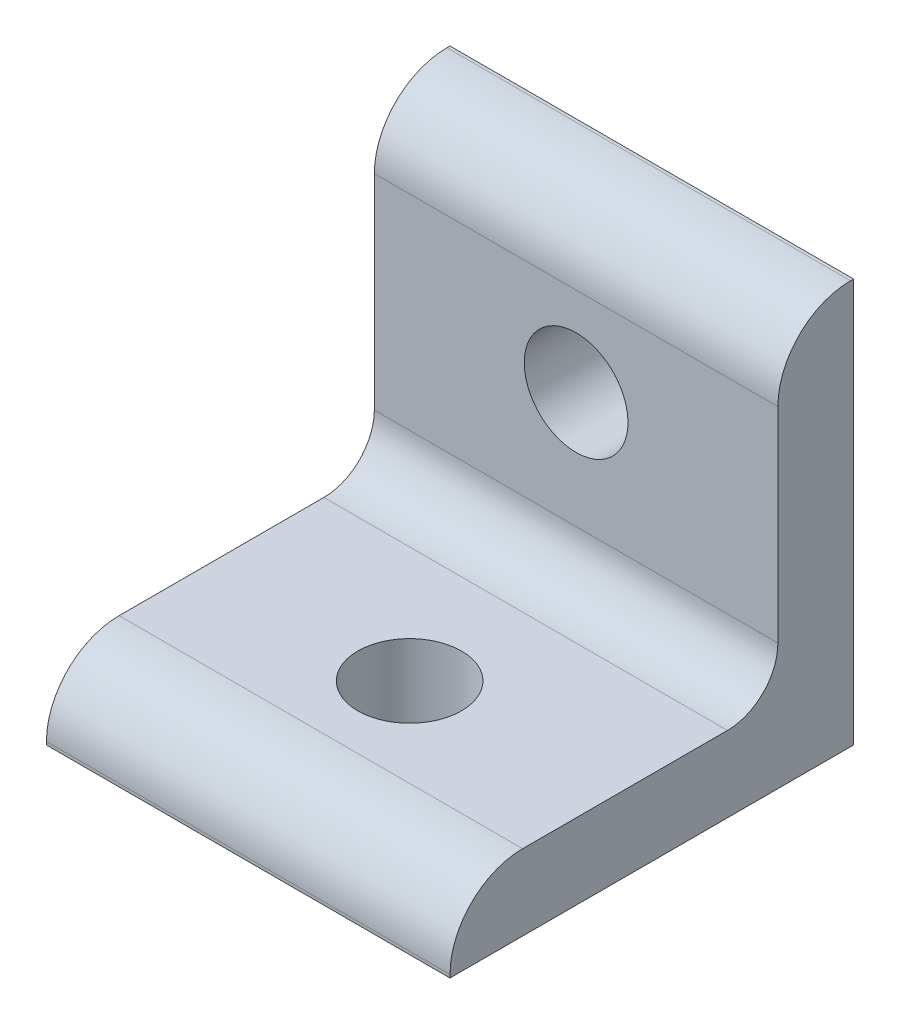
ISO-10303-21;
HEADER;
FILE_DESCRIPTION(('STEP AP214'),'2;1');
FILE_NAME('part.step','',(''),(''),'','','');
FILE_SCHEMA(('AUTOMOTIVE_DESIGN { 1 0 10303 214 1 1 1 1 }'));
ENDSEC;
DATA;
#1=APPLICATION_CONTEXT('core data for automotive mechanical design processes');
#2=APPLICATION_PROTOCOL_DEFINITION('international standard','automotive_design',2000,#1);
#3=PRODUCT_CONTEXT('',#1,'mechanical');
#4=PRODUCT('Part','Part','',(#3));
#5=PRODUCT_RELATED_PRODUCT_CATEGORY('part','',(#4));
#6=PRODUCT_DEFINITION_FORMATION('','',#4);
#7=PRODUCT_DEFINITION_CONTEXT('part definition',#1,'design');
#8=PRODUCT_DEFINITION('design','',#6,#7);
#9=PRODUCT_DEFINITION_SHAPE('','',#8);
#10=(LENGTH_UNIT() NAMED_UNIT(*) SI_UNIT(.MILLI.,.METRE.));
#11=(NAMED_UNIT(*) PLANE_ANGLE_UNIT() SI_UNIT($,.RADIAN.));
#12=(NAMED_UNIT(*) SI_UNIT($,.STERADIAN.) SOLID_ANGLE_UNIT());
#13=UNCERTAINTY_MEASURE_WITH_UNIT(LENGTH_MEASURE(1.E-05),#10,'distance_accuracy_value','');
#14=(GEOMETRIC_REPRESENTATION_CONTEXT(3) GLOBAL_UNCERTAINTY_ASSIGNED_CONTEXT((#13)) GLOBAL_UNIT_ASSIGNED_CONTEXT((#10,
#11,#12)) REPRESENTATION_CONTEXT('',''));
#15=CARTESIAN_POINT('',(0.,0.,0.));
#16=DIRECTION('',(0.,0.,1.));
#17=DIRECTION('',(1.,0.,0.));
#18=AXIS2_PLACEMENT_3D('',#15,#16,#17);
#19=CARTESIAN_POINT('',(25.4,25.4,0.));
#20=DIRECTION('',(0.,0.,-1.));
#21=DIRECTION('',(-1.,0.,0.));
#22=AXIS2_PLACEMENT_3D('',#19,#20,#21);
#23=PLANE('',#22);
#24=CARTESIAN_POINT('',(12.7,15.24,0.));
#25=DIRECTION('',(0.,0.,-1.));
#26=DIRECTION('',(-1.,0.,0.));
#27=AXIS2_PLACEMENT_3D('',#24,#25,#26);
#28=CIRCLE('',#27,3.2639);
#29=CARTESIAN_POINT('',(9.4361,15.24,0.));
#30=VERTEX_POINT('',#29);
#31=EDGE_CURVE('E224',#30,#30,#28,.T.);
#32=ORIENTED_EDGE('',*,*,#31,.F.);
#33=EDGE_LOOP('',(#32));
#34=FACE_BOUND('',#33,.T.);
#35=DIRECTION('',(0.,-1.,0.));
#36=VECTOR('',#35,1.);
#37=CARTESIAN_POINT('',(0.,25.4,0.));
#38=LINE('',#37,#36);
#39=CARTESIAN_POINT('',(0.,25.4,0.));
#40=VERTEX_POINT('',#39);
#41=CARTESIAN_POINT('',(0.,0.,0.));
#42=VERTEX_POINT('',#41);
#43=EDGE_CURVE('E144',#40,#42,#38,.T.);
#44=ORIENTED_EDGE('',*,*,#43,.F.);
#45=DIRECTION('',(-1.,0.,0.));
#46=VECTOR('',#45,1.);
#47=CARTESIAN_POINT('',(25.4,25.4,0.));
#48=LINE('',#47,#46);
#49=CARTESIAN_POINT('',(25.4,25.4,0.));
#50=VERTEX_POINT('',#49);
#51=EDGE_CURVE('E11',#50,#40,#48,.T.);
#52=ORIENTED_EDGE('',*,*,#51,.F.);
#53=DIRECTION('',(0.,-1.,0.));
#54=VECTOR('',#53,1.);
#55=CARTESIAN_POINT('',(25.4,25.4,0.));
#56=LINE('',#55,#54);
#57=CARTESIAN_POINT('',(25.4,0.,0.));
#58=VERTEX_POINT('',#57);
#59=EDGE_CURVE('E168',#50,#58,#56,.T.);
#60=ORIENTED_EDGE('',*,*,#59,.T.);
#61=DIRECTION('',(-1.,0.,0.));
#62=VECTOR('',#61,1.);
#63=CARTESIAN_POINT('',(25.4,0.,0.));
#64=LINE('',#63,#62);
#65=EDGE_CURVE('E44',#58,#42,#64,.T.);
#66=ORIENTED_EDGE('',*,*,#65,.T.);
#67=EDGE_LOOP('',(#44,#52,#60,#66));
#68=FACE_BOUND('',#67,.T.);
#69=ADVANCED_FACE('F41',(#34,#68),#23,.T.);
#70=CARTESIAN_POINT('',(25.4,25.4,0.));
#71=DIRECTION('',(0.,1.,0.));
#72=DIRECTION('',(0.,0.,1.));
#73=AXIS2_PLACEMENT_3D('',#70,#71,#72);
#74=PLANE('',#73);
#75=DIRECTION('',(0.,0.,-1.));
#76=VECTOR('',#75,1.);
#77=CARTESIAN_POINT('',(0.,25.4,0.));
#78=LINE('',#77,#76);
#79=CARTESIAN_POINT('',(0.,25.4,0.190499999999996));
#80=VERTEX_POINT('',#79);
#81=EDGE_CURVE('E166',#80,#40,#78,.T.);
#82=ORIENTED_EDGE('',*,*,#81,.F.);
#83=DIRECTION('',(-1.,0.,0.));
#84=VECTOR('',#83,1.);
#85=CARTESIAN_POINT('',(25.4,25.4,0.190499999999996));
#86=LINE('',#85,#84);
#87=CARTESIAN_POINT('',(25.4,25.4,0.190499999999996));
#88=VERTEX_POINT('',#87);
#89=EDGE_CURVE('E50',#88,#80,#86,.T.);
#90=ORIENTED_EDGE('',*,*,#89,.F.);
#91=DIRECTION('',(0.,0.,-1.));
#92=VECTOR('',#91,1.);
#93=CARTESIAN_POINT('',(25.4,25.4,0.));
#94=LINE('',#93,#92);
#95=EDGE_CURVE('E134',#88,#50,#94,.T.);
#96=ORIENTED_EDGE('',*,*,#95,.T.);
#97=ORIENTED_EDGE('',*,*,#51,.T.);
#98=EDGE_LOOP('',(#82,#90,#96,#97));
#99=FACE_BOUND('',#98,.T.);
#100=ADVANCED_FACE('F182',(#99),#74,.T.);
#101=CARTESIAN_POINT('',(25.4,20.828,0.190499999999996));
#102=DIRECTION('',(-1.,0.,0.));
#103=DIRECTION('',(0.,0.,1.));
#104=AXIS2_PLACEMENT_3D('',#101,#102,#103);
#105=CYLINDRICAL_SURFACE('',#104,4.572);
#106=CARTESIAN_POINT('',(0.,20.828,0.190499999999996));
#107=DIRECTION('',(-1.,0.,0.));
#108=DIRECTION('',(0.,0.,1.));
#109=AXIS2_PLACEMENT_3D('',#106,#107,#108);
#110=CIRCLE('',#109,4.572);
#111=CARTESIAN_POINT('',(0.,20.828,4.7625));
#112=VERTEX_POINT('',#111);
#113=EDGE_CURVE('E121',#112,#80,#110,.T.);
#114=ORIENTED_EDGE('',*,*,#113,.F.);
#115=DIRECTION('',(-1.,0.,0.));
#116=VECTOR('',#115,1.);
#117=CARTESIAN_POINT('',(25.4,20.828,4.7625));
#118=LINE('',#117,#116);
#119=CARTESIAN_POINT('',(25.4,20.828,4.7625));
#120=VERTEX_POINT('',#119);
#121=EDGE_CURVE('E116',#120,#112,#118,.T.);
#122=ORIENTED_EDGE('',*,*,#121,.F.);
#123=CARTESIAN_POINT('',(25.4,20.828,0.190499999999996));
#124=DIRECTION('',(-1.,0.,0.));
#125=DIRECTION('',(0.,0.,1.));
#126=AXIS2_PLACEMENT_3D('',#123,#124,#125);
#127=CIRCLE('',#126,4.572);
#128=EDGE_CURVE('E119',#120,#88,#127,.T.);
#129=ORIENTED_EDGE('',*,*,#128,.T.);
#130=ORIENTED_EDGE('',*,*,#89,.T.);
#131=EDGE_LOOP('',(#114,#122,#129,#130));
#132=FACE_BOUND('',#131,.T.);
#133=ADVANCED_FACE('F118',(#132),#105,.T.);
#134=CARTESIAN_POINT('',(25.4,7.9375,4.7625));
#135=DIRECTION('',(0.,0.,1.));
#136=DIRECTION('',(0.,-1.,0.));
#137=AXIS2_PLACEMENT_3D('',#134,#135,#136);
#138=PLANE('',#137);
#139=CARTESIAN_POINT('',(12.7,15.24,4.7625));
#140=DIRECTION('',(0.,0.,1.));
#141=DIRECTION('',(0.,-1.,0.));
#142=AXIS2_PLACEMENT_3D('',#139,#140,#141);
#143=CIRCLE('',#142,3.2639);
#144=CARTESIAN_POINT('',(12.7,11.9761,4.7625));
#145=VERTEX_POINT('',#144);
#146=EDGE_CURVE('E148',#145,#145,#143,.T.);
#147=ORIENTED_EDGE('',*,*,#146,.F.);
#148=EDGE_LOOP('',(#147));
#149=FACE_BOUND('',#148,.T.);
#150=DIRECTION('',(0.,1.,0.));
#151=VECTOR('',#150,1.);
#152=CARTESIAN_POINT('',(0.,7.9375,4.7625));
#153=LINE('',#152,#151);
#154=CARTESIAN_POINT('',(0.,7.9375,4.7625));
#155=VERTEX_POINT('',#154);
#156=EDGE_CURVE('E163',#155,#112,#153,.T.);
#157=ORIENTED_EDGE('',*,*,#156,.F.);
#158=DIRECTION('',(-1.,0.,0.));
#159=VECTOR('',#158,1.);
#160=CARTESIAN_POINT('',(25.4,7.9375,4.7625));
#161=LINE('',#160,#159);
#162=CARTESIAN_POINT('',(25.4,7.9375,4.7625));
#163=VERTEX_POINT('',#162);
#164=EDGE_CURVE('E126',#163,#155,#161,.T.);
#165=ORIENTED_EDGE('',*,*,#164,.F.);
#166=DIRECTION('',(0.,1.,0.));
#167=VECTOR('',#166,1.);
#168=CARTESIAN_POINT('',(25.4,7.9375,4.7625));
#169=LINE('',#168,#167);
#170=EDGE_CURVE('E132',#163,#120,#169,.T.);
#171=ORIENTED_EDGE('',*,*,#170,.T.);
#172=ORIENTED_EDGE('',*,*,#121,.T.);
#173=EDGE_LOOP('',(#157,#165,#171,#172));
#174=FACE_BOUND('',#173,.T.);
#175=ADVANCED_FACE('F136',(#149,#174),#138,.T.);
#176=CARTESIAN_POINT('',(25.4,7.9375,7.9375));
#177=DIRECTION('',(-1.,0.,0.));
#178=DIRECTION('',(0.,0.,1.));
#179=AXIS2_PLACEMENT_3D('',#176,#177,#178);
#180=CYLINDRICAL_SURFACE('',#179,3.175);
#181=CARTESIAN_POINT('',(0.,7.9375,7.9375));
#182=DIRECTION('',(1.,0.,0.));
#183=DIRECTION('',(0.,0.,-1.));
#184=AXIS2_PLACEMENT_3D('',#181,#182,#183);
#185=CIRCLE('',#184,3.175);
#186=CARTESIAN_POINT('',(0.,4.7625,7.9375));
#187=VERTEX_POINT('',#186);
#188=EDGE_CURVE('E160',#187,#155,#185,.T.);
#189=ORIENTED_EDGE('',*,*,#188,.F.);
#190=DIRECTION('',(-1.,0.,0.));
#191=VECTOR('',#190,1.);
#192=CARTESIAN_POINT('',(25.4,4.7625,7.9375));
#193=LINE('',#192,#191);
#194=CARTESIAN_POINT('',(25.4,4.7625,7.9375));
#195=VERTEX_POINT('',#194);
#196=EDGE_CURVE('E172',#195,#187,#193,.T.);
#197=ORIENTED_EDGE('',*,*,#196,.F.);
#198=CARTESIAN_POINT('',(25.4,7.9375,7.9375));
#199=DIRECTION('',(1.,0.,0.));
#200=DIRECTION('',(0.,0.,-1.));
#201=AXIS2_PLACEMENT_3D('',#198,#199,#200);
#202=CIRCLE('',#201,3.175);
#203=EDGE_CURVE('E137',#195,#163,#202,.T.);
#204=ORIENTED_EDGE('',*,*,#203,.T.);
#205=ORIENTED_EDGE('',*,*,#164,.T.);
#206=EDGE_LOOP('',(#189,#197,#204,#205));
#207=FACE_BOUND('',#206,.T.);
#208=ADVANCED_FACE('F196',(#207),#180,.F.);
#209=CARTESIAN_POINT('',(25.4,4.7625,20.828));
#210=DIRECTION('',(0.,1.,0.));
#211=DIRECTION('',(0.,0.,1.));
#212=AXIS2_PLACEMENT_3D('',#209,#210,#211);
#213=PLANE('',#212);
#214=CARTESIAN_POINT('',(12.7,4.7625,15.24));
#215=DIRECTION('',(0.,1.,0.));
#216=DIRECTION('',(0.,0.,1.));
#217=AXIS2_PLACEMENT_3D('',#214,#215,#216);
#218=CIRCLE('',#217,3.26389999999999);
#219=CARTESIAN_POINT('',(12.7,4.7625,18.5039));
#220=VERTEX_POINT('',#219);
#221=EDGE_CURVE('E221',#220,#220,#218,.T.);
#222=ORIENTED_EDGE('',*,*,#221,.F.);
#223=EDGE_LOOP('',(#222));
#224=FACE_BOUND('',#223,.T.);
#225=DIRECTION('',(0.,0.,-1.));
#226=VECTOR('',#225,1.);
#227=CARTESIAN_POINT('',(0.,4.7625,20.828));
#228=LINE('',#227,#226);
#229=CARTESIAN_POINT('',(0.,4.7625,20.828));
#230=VERTEX_POINT('',#229);
#231=EDGE_CURVE('E157',#230,#187,#228,.T.);
#232=ORIENTED_EDGE('',*,*,#231,.F.);
#233=DIRECTION('',(-1.,0.,0.));
#234=VECTOR('',#233,1.);
#235=CARTESIAN_POINT('',(25.4,4.7625,20.828));
#236=LINE('',#235,#234);
#237=CARTESIAN_POINT('',(25.4,4.7625,20.828));
#238=VERTEX_POINT('',#237);
#239=EDGE_CURVE('E174',#238,#230,#236,.T.);
#240=ORIENTED_EDGE('',*,*,#239,.F.);
#241=DIRECTION('',(0.,0.,-1.));
#242=VECTOR('',#241,1.);
#243=CARTESIAN_POINT('',(25.4,4.7625,20.828));
#244=LINE('',#243,#242);
#245=EDGE_CURVE('E139',#238,#195,#244,.T.);
#246=ORIENTED_EDGE('',*,*,#245,.T.);
#247=ORIENTED_EDGE('',*,*,#196,.T.);
#248=EDGE_LOOP('',(#232,#240,#246,#247));
#249=FACE_BOUND('',#248,.T.);
#250=ADVANCED_FACE('F200',(#224,#249),#213,.T.);
#251=CARTESIAN_POINT('',(25.4,0.1905,20.828));
#252=DIRECTION('',(-1.,0.,0.));
#253=DIRECTION('',(0.,0.,1.));
#254=AXIS2_PLACEMENT_3D('',#251,#252,#253);
#255=CYLINDRICAL_SURFACE('',#254,4.572);
#256=CARTESIAN_POINT('',(0.,0.1905,20.828));
#257=DIRECTION('',(-1.,0.,0.));
#258=DIRECTION('',(0.,0.,-1.));
#259=AXIS2_PLACEMENT_3D('',#256,#257,#258);
#260=CIRCLE('',#259,4.572);
#261=CARTESIAN_POINT('',(0.,0.1905,25.4));
#262=VERTEX_POINT('',#261);
#263=EDGE_CURVE('E154',#262,#230,#260,.T.);
#264=ORIENTED_EDGE('',*,*,#263,.F.);
#265=DIRECTION('',(-1.,0.,0.));
#266=VECTOR('',#265,1.);
#267=CARTESIAN_POINT('',(25.4,0.1905,25.4));
#268=LINE('',#267,#266);
#269=CARTESIAN_POINT('',(25.4,0.1905,25.4));
#270=VERTEX_POINT('',#269);
#271=EDGE_CURVE('E176',#270,#262,#268,.T.);
#272=ORIENTED_EDGE('',*,*,#271,.F.);
#273=CARTESIAN_POINT('',(25.4,0.1905,20.828));
#274=DIRECTION('',(-1.,0.,0.));
#275=DIRECTION('',(0.,0.,-1.));
#276=AXIS2_PLACEMENT_3D('',#273,#274,#275);
#277=CIRCLE('',#276,4.572);
#278=EDGE_CURVE('E237',#270,#238,#277,.T.);
#279=ORIENTED_EDGE('',*,*,#278,.T.);
#280=ORIENTED_EDGE('',*,*,#239,.T.);
#281=EDGE_LOOP('',(#264,#272,#279,#280));
#282=FACE_BOUND('',#281,.T.);
#283=ADVANCED_FACE('F204',(#282),#255,.T.);
#284=CARTESIAN_POINT('',(25.4,0.,25.4));
#285=DIRECTION('',(0.,0.,1.));
#286=DIRECTION('',(0.,-1.,0.));
#287=AXIS2_PLACEMENT_3D('',#284,#285,#286);
#288=PLANE('',#287);
#289=DIRECTION('',(0.,1.,0.));
#290=VECTOR('',#289,1.);
#291=CARTESIAN_POINT('',(0.,0.,25.4));
#292=LINE('',#291,#290);
#293=CARTESIAN_POINT('',(0.,0.,25.4));
#294=VERTEX_POINT('',#293);
#295=EDGE_CURVE('E151',#294,#262,#292,.T.);
#296=ORIENTED_EDGE('',*,*,#295,.F.);
#297=DIRECTION('',(-1.,0.,0.));
#298=VECTOR('',#297,1.);
#299=CARTESIAN_POINT('',(25.4,0.,25.4));
#300=LINE('',#299,#298);
#301=CARTESIAN_POINT('',(25.4,0.,25.4));
#302=VERTEX_POINT('',#301);
#303=EDGE_CURVE('E177',#302,#294,#300,.T.);
#304=ORIENTED_EDGE('',*,*,#303,.F.);
#305=DIRECTION('',(0.,1.,0.));
#306=VECTOR('',#305,1.);
#307=CARTESIAN_POINT('',(25.4,0.,25.4));
#308=LINE('',#307,#306);
#309=EDGE_CURVE('E234',#302,#270,#308,.T.);
#310=ORIENTED_EDGE('',*,*,#309,.T.);
#311=ORIENTED_EDGE('',*,*,#271,.T.);
#312=EDGE_LOOP('',(#296,#304,#310,#311));
#313=FACE_BOUND('',#312,.T.);
#314=ADVANCED_FACE('F208',(#313),#288,.T.);
#315=CARTESIAN_POINT('',(25.4,0.,0.));
#316=DIRECTION('',(0.,-1.,0.));
#317=DIRECTION('',(0.,0.,-1.));
#318=AXIS2_PLACEMENT_3D('',#315,#316,#317);
#319=PLANE('',#318);
#320=CARTESIAN_POINT('',(12.7,0.,15.24));
#321=DIRECTION('',(0.,-1.,0.));
#322=DIRECTION('',(0.,0.,-1.));
#323=AXIS2_PLACEMENT_3D('',#320,#321,#322);
#324=CIRCLE('',#323,3.26389999999999);
#325=CARTESIAN_POINT('',(12.7,0.,11.9761));
#326=VERTEX_POINT('',#325);
#327=EDGE_CURVE('E219',#326,#326,#324,.T.);
#328=ORIENTED_EDGE('',*,*,#327,.F.);
#329=EDGE_LOOP('',(#328));
#330=FACE_BOUND('',#329,.T.);
#331=DIRECTION('',(0.,0.,1.));
#332=VECTOR('',#331,1.);
#333=CARTESIAN_POINT('',(0.,0.,0.));
#334=LINE('',#333,#332);
#335=EDGE_CURVE('E147',#42,#294,#334,.T.);
#336=ORIENTED_EDGE('',*,*,#335,.F.);
#337=ORIENTED_EDGE('',*,*,#65,.F.);
#338=DIRECTION('',(0.,0.,1.));
#339=VECTOR('',#338,1.);
#340=CARTESIAN_POINT('',(25.4,0.,0.));
#341=LINE('',#340,#339);
#342=EDGE_CURVE('E232',#58,#302,#341,.T.);
#343=ORIENTED_EDGE('',*,*,#342,.T.);
#344=ORIENTED_EDGE('',*,*,#303,.T.);
#345=EDGE_LOOP('',(#336,#337,#343,#344));
#346=FACE_BOUND('',#345,.T.);
#347=ADVANCED_FACE('F179',(#330,#346),#319,.T.);
#348=CARTESIAN_POINT('',(25.4,0.1905,20.828));
#349=DIRECTION('',(1.,0.,0.));
#350=DIRECTION('',(0.,0.,-1.));
#351=AXIS2_PLACEMENT_3D('',#348,#349,#350);
#352=PLANE('',#351);
#353=ORIENTED_EDGE('',*,*,#59,.F.);
#354=ORIENTED_EDGE('',*,*,#95,.F.);
#355=ORIENTED_EDGE('',*,*,#128,.F.);
#356=ORIENTED_EDGE('',*,*,#170,.F.);
#357=ORIENTED_EDGE('',*,*,#203,.F.);
#358=ORIENTED_EDGE('',*,*,#245,.F.);
#359=ORIENTED_EDGE('',*,*,#278,.F.);
#360=ORIENTED_EDGE('',*,*,#309,.F.);
#361=ORIENTED_EDGE('',*,*,#342,.F.);
#362=EDGE_LOOP('',(#353,#354,#355,#356,#357,#358,#359,#360,#361));
#363=FACE_BOUND('',#362,.T.);
#364=ADVANCED_FACE('F130',(#363),#352,.T.);
#365=CARTESIAN_POINT('',(0.,0.1905,20.828));
#366=DIRECTION('',(1.,0.,0.));
#367=DIRECTION('',(0.,0.,-1.));
#368=AXIS2_PLACEMENT_3D('',#365,#366,#367);
#369=PLANE('',#368);
#370=ORIENTED_EDGE('',*,*,#43,.T.);
#371=ORIENTED_EDGE('',*,*,#335,.T.);
#372=ORIENTED_EDGE('',*,*,#295,.T.);
#373=ORIENTED_EDGE('',*,*,#263,.T.);
#374=ORIENTED_EDGE('',*,*,#231,.T.);
#375=ORIENTED_EDGE('',*,*,#188,.T.);
#376=ORIENTED_EDGE('',*,*,#156,.T.);
#377=ORIENTED_EDGE('',*,*,#113,.T.);
#378=ORIENTED_EDGE('',*,*,#81,.T.);
#379=EDGE_LOOP('',(#370,#371,#372,#373,#374,#375,#376,#377,#378));
#380=FACE_BOUND('',#379,.T.);
#381=ADVANCED_FACE('F181',(#380),#369,.F.);
#382=CARTESIAN_POINT('',(12.7,15.24,0.));
#383=DIRECTION('',(0.,0.,-1.));
#384=DIRECTION('',(-1.,0.,0.));
#385=AXIS2_PLACEMENT_3D('',#382,#383,#384);
#386=CYLINDRICAL_SURFACE('',#385,3.2639);
#387=ORIENTED_EDGE('',*,*,#146,.T.);
#388=EDGE_LOOP('',(#387));
#389=FACE_BOUND('',#388,.T.);
#390=ORIENTED_EDGE('',*,*,#31,.T.);
#391=EDGE_LOOP('',(#390));
#392=FACE_BOUND('',#391,.T.);
#393=ADVANCED_FACE('F249',(#389,#392),#386,.F.);
#394=CARTESIAN_POINT('',(12.7,0.,15.24));
#395=DIRECTION('',(0.,-1.,0.));
#396=DIRECTION('',(0.,0.,-1.));
#397=AXIS2_PLACEMENT_3D('',#394,#395,#396);
#398=CYLINDRICAL_SURFACE('',#397,3.26389999999999);
#399=ORIENTED_EDGE('',*,*,#221,.T.);
#400=EDGE_LOOP('',(#399));
#401=FACE_BOUND('',#400,.T.);
#402=ORIENTED_EDGE('',*,*,#327,.T.);
#403=EDGE_LOOP('',(#402));
#404=FACE_BOUND('',#403,.T.);
#405=ADVANCED_FACE('F252',(#401,#404),#398,.F.);
#406=CLOSED_SHELL('',(#69,#100,#133,#175,#208,#250,#283,#314,#347,#364,#381,#393,#405));
#407=MANIFOLD_SOLID_BREP('B2',#406);
#408=ADVANCED_BREP_SHAPE_REPRESENTATION('',(#18,#407),#14);
#409=SHAPE_DEFINITION_REPRESENTATION(#9,#408);
ENDSEC;
END-ISO-10303-21;
